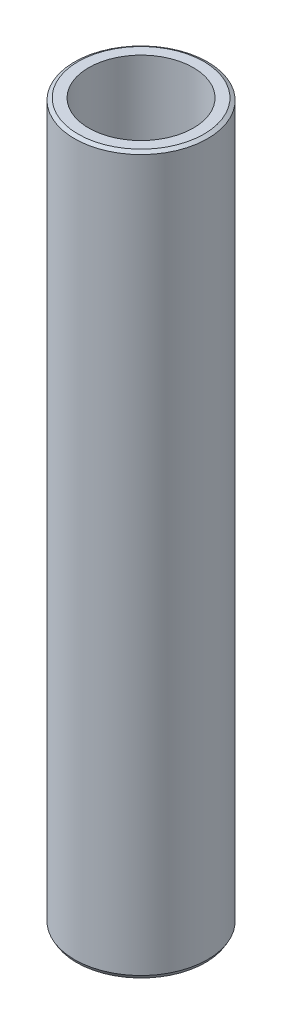
ISO-10303-21;
HEADER;
FILE_DESCRIPTION(('STEP AP214'),'2;1');
FILE_NAME('part.step','',(''),(''),'','','');
FILE_SCHEMA(('AUTOMOTIVE_DESIGN { 1 0 10303 214 1 1 1 1 }'));
ENDSEC;
DATA;
#1=APPLICATION_CONTEXT('core data for automotive mechanical design processes');
#2=APPLICATION_PROTOCOL_DEFINITION('international standard','automotive_design',2000,#1);
#3=PRODUCT_CONTEXT('',#1,'mechanical');
#4=PRODUCT('Part','Part','',(#3));
#5=PRODUCT_RELATED_PRODUCT_CATEGORY('part','',(#4));
#6=PRODUCT_DEFINITION_FORMATION('','',#4);
#7=PRODUCT_DEFINITION_CONTEXT('part definition',#1,'design');
#8=PRODUCT_DEFINITION('design','',#6,#7);
#9=PRODUCT_DEFINITION_SHAPE('','',#8);
#10=(LENGTH_UNIT() NAMED_UNIT(*) SI_UNIT(.MILLI.,.METRE.));
#11=(NAMED_UNIT(*) PLANE_ANGLE_UNIT() SI_UNIT($,.RADIAN.));
#12=(NAMED_UNIT(*) SI_UNIT($,.STERADIAN.) SOLID_ANGLE_UNIT());
#13=UNCERTAINTY_MEASURE_WITH_UNIT(LENGTH_MEASURE(1.E-05),#10,'distance_accuracy_value','');
#14=(GEOMETRIC_REPRESENTATION_CONTEXT(3) GLOBAL_UNCERTAINTY_ASSIGNED_CONTEXT((#13)) GLOBAL_UNIT_ASSIGNED_CONTEXT((#10,
#11,#12)) REPRESENTATION_CONTEXT('',''));
#15=CARTESIAN_POINT('',(0.,0.,0.));
#16=DIRECTION('',(0.,0.,1.));
#17=DIRECTION('',(1.,0.,0.));
#18=AXIS2_PLACEMENT_3D('',#15,#16,#17);
#19=CARTESIAN_POINT('',(0.,484.659316944639,0.));
#20=DIRECTION('',(0.,-1.,0.));
#21=DIRECTION('',(0.,0.,-1.));
#22=AXIS2_PLACEMENT_3D('',#19,#20,#21);
#23=CYLINDRICAL_SURFACE('',#22,45.);
#24=CARTESIAN_POINT('',(0.,483.230887353075,0.));
#25=DIRECTION('',(0.,1.,0.));
#26=DIRECTION('',(0.,0.,1.));
#27=AXIS2_PLACEMENT_3D('',#24,#25,#26);
#28=CIRCLE('',#27,45.);
#29=CARTESIAN_POINT('',(0.,483.230887353075,-45.));
#30=VERTEX_POINT('',#29);
#31=EDGE_CURVE('E50',#30,#30,#28,.F.);
#32=CARTESIAN_POINT('',(0.,2.4741126276247,0.));
#33=DIRECTION('',(0.,1.,0.));
#34=DIRECTION('',(0.,0.,1.));
#35=AXIS2_PLACEMENT_3D('',#32,#33,#34);
#36=CIRCLE('',#35,45.);
#37=CARTESIAN_POINT('',(0.,2.4741126276247,-45.));
#38=VERTEX_POINT('',#37);
#39=EDGE_CURVE('E51',#38,#38,#36,.T.);
#40=CARTESIAN_POINT('',(0.,483.230887353075,-45.));
#41=CARTESIAN_POINT('',(0.,478.223004283018,-45.));
#42=CARTESIAN_POINT('',(0.,473.215121212961,-45.));
#43=CARTESIAN_POINT('',(0.,463.199355072848,-45.));
#44=CARTESIAN_POINT('',(0.,458.191472002791,-45.));
#45=CARTESIAN_POINT('',(0.,448.175705862677,-45.));
#46=CARTESIAN_POINT('',(0.,443.167822792621,-45.));
#47=CARTESIAN_POINT('',(0.,433.152056652507,-45.));
#48=CARTESIAN_POINT('',(0.,428.14417358245,-45.));
#49=CARTESIAN_POINT('',(0.,418.128407442337,-45.));
#50=CARTESIAN_POINT('',(0.,413.12052437228,-45.));
#51=CARTESIAN_POINT('',(0.,403.104758232166,-45.));
#52=CARTESIAN_POINT('',(0.,398.09687516211,-45.));
#53=CARTESIAN_POINT('',(0.,388.081109021996,-45.));
#54=CARTESIAN_POINT('',(0.,383.073225951939,-45.));
#55=CARTESIAN_POINT('',(0.,373.057459811826,-45.));
#56=CARTESIAN_POINT('',(0.,368.049576741769,-45.));
#57=CARTESIAN_POINT('',(0.,358.033810601655,-45.));
#58=CARTESIAN_POINT('',(0.,353.025927531599,-45.));
#59=CARTESIAN_POINT('',(0.,343.010161391485,-45.));
#60=CARTESIAN_POINT('',(0.,338.002278321428,-45.));
#61=CARTESIAN_POINT('',(0.,327.986512181315,-45.));
#62=CARTESIAN_POINT('',(0.,322.978629111258,-45.));
#63=CARTESIAN_POINT('',(0.,312.962862971144,-45.));
#64=CARTESIAN_POINT('',(0.,307.954979901088,-45.));
#65=CARTESIAN_POINT('',(0.,297.939213760974,-45.));
#66=CARTESIAN_POINT('',(0.,292.931330690917,-45.));
#67=CARTESIAN_POINT('',(0.,282.915564550804,-45.));
#68=CARTESIAN_POINT('',(0.,277.907681480747,-45.));
#69=CARTESIAN_POINT('',(0.,267.891915340634,-45.));
#70=CARTESIAN_POINT('',(0.,262.884032270577,-45.));
#71=CARTESIAN_POINT('',(0.,252.868266130463,-45.));
#72=CARTESIAN_POINT('',(0.,247.860383060406,-45.));
#73=CARTESIAN_POINT('',(0.,237.844616920293,-45.));
#74=CARTESIAN_POINT('',(0.,232.836733850236,-45.));
#75=CARTESIAN_POINT('',(0.,222.820967710123,-45.));
#76=CARTESIAN_POINT('',(0.,217.813084640066,-45.));
#77=CARTESIAN_POINT('',(0.,207.797318499952,-45.));
#78=CARTESIAN_POINT('',(0.,202.789435429896,-45.));
#79=CARTESIAN_POINT('',(0.,192.773669289782,-45.));
#80=CARTESIAN_POINT('',(0.,187.765786219725,-45.));
#81=CARTESIAN_POINT('',(0.,177.750020079612,-45.));
#82=CARTESIAN_POINT('',(0.,172.742137009555,-45.));
#83=CARTESIAN_POINT('',(0.,162.726370869441,-45.));
#84=CARTESIAN_POINT('',(0.,157.718487799385,-45.));
#85=CARTESIAN_POINT('',(0.,147.702721659271,-45.));
#86=CARTESIAN_POINT('',(0.,142.694838589214,-45.));
#87=CARTESIAN_POINT('',(0.,132.679072449101,-45.));
#88=CARTESIAN_POINT('',(0.,127.671189379044,-45.));
#89=CARTESIAN_POINT('',(0.,117.65542323893,-45.));
#90=CARTESIAN_POINT('',(0.,112.647540168874,-45.));
#91=CARTESIAN_POINT('',(0.,102.63177402876,-45.));
#92=CARTESIAN_POINT('',(0.,97.6238909587034,-45.));
#93=CARTESIAN_POINT('',(0.,87.6081248185898,-45.));
#94=CARTESIAN_POINT('',(0.,82.6002417485331,-45.));
#95=CARTESIAN_POINT('',(0.,72.5844756084195,-45.));
#96=CARTESIAN_POINT('',(0.,67.5765925383628,-45.));
#97=CARTESIAN_POINT('',(0.,57.5608263982492,-45.));
#98=CARTESIAN_POINT('',(0.,52.5529433281925,-45.));
#99=CARTESIAN_POINT('',(0.,42.5371771880789,-45.));
#100=CARTESIAN_POINT('',(0.,37.5292941180221,-45.));
#101=CARTESIAN_POINT('',(0.,27.5135279779085,-45.));
#102=CARTESIAN_POINT('',(0.,22.5056449078518,-45.));
#103=CARTESIAN_POINT('',(0.,12.4898787677382,-45.));
#104=CARTESIAN_POINT('',(0.,7.48199569768147,-45.));
#105=CARTESIAN_POINT('',(0.,2.4741126276247,-45.));
#106=B_SPLINE_CURVE_WITH_KNOTS('',3,(#40,#41,#42,#43,#44,#45,#46,#47,#48,#49,#50,#51,#52,#53,
#54,#55,#56,#57,#58,#59,#60,#61,#62,#63,#64,#65,#66,#67,#68,#69,#70,#71,#72,#73,#74,#75,#76,#77,
#78,#79,#80,#81,#82,#83,#84,#85,#86,#87,#88,#89,#90,#91,#92,#93,#94,#95,#96,#97,#98,#99,#100,
#101,#102,#103,#104,#105),.UNSPECIFIED.,.F.,.F.,(4,2,2,2,2,2,2,2,2,2,2,2,2,2,2,2,2,2,2,2,2,2,2,
2,2,2,2,2,2,2,2,2,4),(0.,15.0236492101704,30.0472984203407,45.070947630511,60.0945968406812,
75.1182460508515,90.1418952610219,105.165544471192,120.189193681362,135.212842891533,
150.236492101703,165.260141311873,180.283790522044,195.307439732214,210.331088942384,
225.354738152555,240.378387362725,255.402036572895,270.425685783066,285.449334993236,
300.472984203406,315.496633413576,330.520282623747,345.543931833917,360.567581044087,
375.591230254258,390.614879464428,405.638528674598,420.662177884769,435.685827094939,
450.709476305109,465.73312551528,480.75677472545),.UNSPECIFIED.);
#107=EDGE_CURVE('BSEAM39',#30,#38,#106,.T.);
#108=ORIENTED_EDGE('',*,*,#31,.T.);
#109=ORIENTED_EDGE('',*,*,#39,.T.);
#110=ORIENTED_EDGE('',*,*,#107,.T.);
#111=ORIENTED_EDGE('',*,*,#107,.F.);
#112=EDGE_LOOP('',(#108,#110,#109,#111));
#113=FACE_BOUND('',#112,.T.);
#114=ADVANCED_FACE('F39',(#113),#23,.T.);
#115=CARTESIAN_POINT('',(0.,484.659316944639,0.));
#116=DIRECTION('',(0.,1.,0.));
#117=DIRECTION('',(0.,0.,1.));
#118=AXIS2_PLACEMENT_3D('',#115,#116,#117);
#119=PLANE('',#118);
#120=CARTESIAN_POINT('',(0.,484.659316944639,0.));
#121=DIRECTION('',(0.,1.,0.));
#122=DIRECTION('',(0.,0.,1.));
#123=AXIS2_PLACEMENT_3D('',#120,#121,#122);
#124=CIRCLE('',#123,42.5258873723763);
#125=CARTESIAN_POINT('',(0.,484.659316944639,42.5258873723763));
#126=VERTEX_POINT('',#125);
#127=EDGE_CURVE('E54',#126,#126,#124,.T.);
#128=ORIENTED_EDGE('',*,*,#127,.T.);
#129=EDGE_LOOP('',(#128));
#130=FACE_BOUND('',#129,.T.);
#131=CARTESIAN_POINT('',(0.,484.659316944639,0.));
#132=DIRECTION('',(0.,1.,0.));
#133=DIRECTION('',(0.,0.,1.));
#134=AXIS2_PLACEMENT_3D('',#131,#132,#133);
#135=CIRCLE('',#134,35.4087724599996);
#136=CARTESIAN_POINT('',(0.,484.659316944639,-35.4087724599996));
#137=VERTEX_POINT('',#136);
#138=EDGE_CURVE('E58',#137,#137,#135,.T.);
#139=ORIENTED_EDGE('',*,*,#138,.F.);
#140=EDGE_LOOP('',(#139));
#141=FACE_BOUND('',#140,.T.);
#142=ADVANCED_FACE('F69',(#130,#141),#119,.T.);
#143=CARTESIAN_POINT('',(0.,0.,0.));
#144=DIRECTION('',(0.,1.,0.));
#145=DIRECTION('',(0.,0.,1.));
#146=AXIS2_PLACEMENT_3D('',#143,#144,#145);
#147=PLANE('',#146);
#148=CARTESIAN_POINT('',(0.,0.,0.));
#149=DIRECTION('',(0.,1.,0.));
#150=DIRECTION('',(0.,0.,1.));
#151=AXIS2_PLACEMENT_3D('',#148,#149,#150);
#152=CIRCLE('',#151,43.5715704084354);
#153=CARTESIAN_POINT('',(0.,0.,43.5715704084354));
#154=VERTEX_POINT('',#153);
#155=EDGE_CURVE('E10',#154,#154,#152,.F.);
#156=ORIENTED_EDGE('',*,*,#155,.T.);
#157=EDGE_LOOP('',(#156));
#158=FACE_BOUND('',#157,.T.);
#159=CARTESIAN_POINT('',(0.,0.,0.));
#160=DIRECTION('',(0.,1.,0.));
#161=DIRECTION('',(0.,0.,1.));
#162=AXIS2_PLACEMENT_3D('',#159,#160,#161);
#163=CIRCLE('',#162,35.4087724599996);
#164=CARTESIAN_POINT('',(0.,0.,-35.4087724599996));
#165=VERTEX_POINT('',#164);
#166=EDGE_CURVE('E63',#165,#165,#163,.T.);
#167=ORIENTED_EDGE('',*,*,#166,.T.);
#168=EDGE_LOOP('',(#167));
#169=FACE_BOUND('',#168,.T.);
#170=ADVANCED_FACE('F75',(#158,#169),#147,.F.);
#171=CARTESIAN_POINT('',(0.,484.659316944639,0.));
#172=DIRECTION('',(0.,-1.,0.));
#173=DIRECTION('',(0.,0.,-1.));
#174=AXIS2_PLACEMENT_3D('',#171,#172,#173);
#175=CYLINDRICAL_SURFACE('',#174,35.4087724599996);
#176=CARTESIAN_POINT('',(0.,484.659316944639,-35.4087724599996));
#177=CARTESIAN_POINT('',(0.,479.610782393132,-35.4087724599996));
#178=CARTESIAN_POINT('',(0.,474.562247841625,-35.4087724599996));
#179=CARTESIAN_POINT('',(0.,464.465178738612,-35.4087724599996));
#180=CARTESIAN_POINT('',(0.,459.416644187105,-35.4087724599996));
#181=CARTESIAN_POINT('',(0.,449.319575084092,-35.4087724599996));
#182=CARTESIAN_POINT('',(0.,444.271040532585,-35.4087724599996));
#183=CARTESIAN_POINT('',(0.,434.173971429572,-35.4087724599996));
#184=CARTESIAN_POINT('',(0.,429.125436878065,-35.4087724599996));
#185=CARTESIAN_POINT('',(0.,419.028367775052,-35.4087724599996));
#186=CARTESIAN_POINT('',(0.,413.979833223545,-35.4087724599996));
#187=CARTESIAN_POINT('',(0.,403.882764120532,-35.4087724599996));
#188=CARTESIAN_POINT('',(0.,398.834229569025,-35.4087724599996));
#189=CARTESIAN_POINT('',(0.,388.737160466012,-35.4087724599996));
#190=CARTESIAN_POINT('',(0.,383.688625914506,-35.4087724599996));
#191=CARTESIAN_POINT('',(0.,373.591556811492,-35.4087724599996));
#192=CARTESIAN_POINT('',(0.,368.543022259986,-35.4087724599996));
#193=CARTESIAN_POINT('',(0.,358.445953156972,-35.4087724599996));
#194=CARTESIAN_POINT('',(0.,353.397418605466,-35.4087724599996));
#195=CARTESIAN_POINT('',(0.,343.300349502452,-35.4087724599996));
#196=CARTESIAN_POINT('',(0.,338.251814950946,-35.4087724599996));
#197=CARTESIAN_POINT('',(0.,328.154745847932,-35.4087724599996));
#198=CARTESIAN_POINT('',(0.,323.106211296426,-35.4087724599996));
#199=CARTESIAN_POINT('',(0.,313.009142193412,-35.4087724599996));
#200=CARTESIAN_POINT('',(0.,307.960607641906,-35.4087724599996));
#201=CARTESIAN_POINT('',(0.,297.863538538892,-35.4087724599996));
#202=CARTESIAN_POINT('',(0.,292.815003987386,-35.4087724599996));
#203=CARTESIAN_POINT('',(0.,282.717934884372,-35.4087724599996));
#204=CARTESIAN_POINT('',(0.,277.669400332866,-35.4087724599996));
#205=CARTESIAN_POINT('',(0.,267.572331229853,-35.4087724599996));
#206=CARTESIAN_POINT('',(0.,262.523796678346,-35.4087724599996));
#207=CARTESIAN_POINT('',(0.,252.426727575333,-35.4087724599996));
#208=CARTESIAN_POINT('',(0.,247.378193023826,-35.4087724599996));
#209=CARTESIAN_POINT('',(0.,237.281123920813,-35.4087724599996));
#210=CARTESIAN_POINT('',(0.,232.232589369306,-35.4087724599996));
#211=CARTESIAN_POINT('',(0.,222.135520266293,-35.4087724599996));
#212=CARTESIAN_POINT('',(0.,217.086985714786,-35.4087724599996));
#213=CARTESIAN_POINT('',(0.,206.989916611773,-35.4087724599996));
#214=CARTESIAN_POINT('',(0.,201.941382060266,-35.4087724599996));
#215=CARTESIAN_POINT('',(0.,191.844312957253,-35.4087724599996));
#216=CARTESIAN_POINT('',(0.,186.795778405746,-35.4087724599996));
#217=CARTESIAN_POINT('',(0.,176.698709302733,-35.4087724599996));
#218=CARTESIAN_POINT('',(0.,171.650174751226,-35.4087724599996));
#219=CARTESIAN_POINT('',(0.,161.553105648213,-35.4087724599996));
#220=CARTESIAN_POINT('',(0.,156.504571096706,-35.4087724599996));
#221=CARTESIAN_POINT('',(0.,146.407501993693,-35.4087724599996));
#222=CARTESIAN_POINT('',(0.,141.358967442186,-35.4087724599996));
#223=CARTESIAN_POINT('',(0.,131.261898339173,-35.4087724599996));
#224=CARTESIAN_POINT('',(0.,126.213363787666,-35.4087724599996));
#225=CARTESIAN_POINT('',(0.,116.116294684653,-35.4087724599996));
#226=CARTESIAN_POINT('',(0.,111.067760133146,-35.4087724599996));
#227=CARTESIAN_POINT('',(0.,100.970691030133,-35.4087724599996));
#228=CARTESIAN_POINT('',(0.,95.9221564786263,-35.4087724599996));
#229=CARTESIAN_POINT('',(0.,85.825087375613,-35.4087724599996));
#230=CARTESIAN_POINT('',(0.,80.7765528241064,-35.4087724599996));
#231=CARTESIAN_POINT('',(0.,70.6794837210931,-35.4087724599996));
#232=CARTESIAN_POINT('',(0.,65.6309491695864,-35.4087724599996));
#233=CARTESIAN_POINT('',(0.,55.5338800665731,-35.4087724599996));
#234=CARTESIAN_POINT('',(0.,50.4853455150665,-35.4087724599996));
#235=CARTESIAN_POINT('',(0.,40.3882764120532,-35.4087724599996));
#236=CARTESIAN_POINT('',(0.,35.3397418605465,-35.4087724599996));
#237=CARTESIAN_POINT('',(0.,25.2426727575332,-35.4087724599996));
#238=CARTESIAN_POINT('',(0.,20.1941382060265,-35.4087724599996));
#239=CARTESIAN_POINT('',(0.,10.0970691030132,-35.4087724599996));
#240=CARTESIAN_POINT('',(0.,5.04853455150659,-35.4087724599996));
#241=CARTESIAN_POINT('',(0.,0.,-35.4087724599996));
#242=B_SPLINE_CURVE_WITH_KNOTS('',3,(#176,#177,#178,#179,#180,#181,#182,#183,#184,#185,#186,
#187,#188,#189,#190,#191,#192,#193,#194,#195,#196,#197,#198,#199,#200,#201,#202,#203,#204,#205,
#206,#207,#208,#209,#210,#211,#212,#213,#214,#215,#216,#217,#218,#219,#220,#221,#222,#223,#224,
#225,#226,#227,#228,#229,#230,#231,#232,#233,#234,#235,#236,#237,#238,#239,#240,#241),
.UNSPECIFIED.,.F.,.F.,(4,2,2,2,2,2,2,2,2,2,2,2,2,2,2,2,2,2,2,2,2,2,2,2,2,2,2,2,2,2,2,2,4),(0.,
15.1456036545199,30.2912073090399,45.4368109635598,60.5824146180798,75.7280182725997,
90.8736219271197,106.01922558164,121.16482923616,136.31043289068,151.4560365452,166.60164019972,
181.747243854239,196.892847508759,212.038451163279,227.184054817799,242.329658472319,
257.475262126839,272.620865781359,287.766469435879,302.912073090399,318.057676744919,
333.203280399439,348.348884053959,363.494487708479,378.640091362999,393.785695017519,
408.931298672039,424.076902326559,439.222505981079,454.368109635599,469.513713290119,
484.659316944639),.UNSPECIFIED.);
#243=EDGE_CURVE('BSEAM70',#137,#165,#242,.T.);
#244=ORIENTED_EDGE('',*,*,#138,.T.);
#245=ORIENTED_EDGE('',*,*,#166,.F.);
#246=ORIENTED_EDGE('',*,*,#243,.T.);
#247=ORIENTED_EDGE('',*,*,#243,.F.);
#248=EDGE_LOOP('',(#244,#246,#245,#247));
#249=FACE_BOUND('',#248,.T.);
#250=ADVANCED_FACE('F70',(#249),#175,.F.);
#251=CARTESIAN_POINT('',(0.,484.659316944639,0.));
#252=DIRECTION('',(0.,-1.,0.));
#253=DIRECTION('',(0.,0.,-1.));
#254=AXIS2_PLACEMENT_3D('',#251,#252,#253);
#255=CONICAL_SURFACE('',#254,42.5258873723763,1.04719755119662);
#256=ORIENTED_EDGE('',*,*,#31,.F.);
#257=EDGE_LOOP('',(#256));
#258=FACE_BOUND('',#257,.T.);
#259=ORIENTED_EDGE('',*,*,#127,.F.);
#260=EDGE_LOOP('',(#259));
#261=FACE_BOUND('',#260,.T.);
#262=ADVANCED_FACE('F81',(#258,#261),#255,.T.);
#263=CARTESIAN_POINT('',(0.,2.4741126276247,0.));
#264=DIRECTION('',(0.,1.,0.));
#265=DIRECTION('',(0.,0.,1.));
#266=AXIS2_PLACEMENT_3D('',#263,#264,#265);
#267=CONICAL_SURFACE('',#266,45.,0.523598775598304);
#268=ORIENTED_EDGE('',*,*,#155,.F.);
#269=EDGE_LOOP('',(#268));
#270=FACE_BOUND('',#269,.T.);
#271=ORIENTED_EDGE('',*,*,#39,.F.);
#272=EDGE_LOOP('',(#271));
#273=FACE_BOUND('',#272,.T.);
#274=ADVANCED_FACE('F45',(#270,#273),#267,.T.);
#275=CLOSED_SHELL('',(#114,#142,#170,#250,#262,#274));
#276=MANIFOLD_SOLID_BREP('B2',#275);
#277=ADVANCED_BREP_SHAPE_REPRESENTATION('',(#18,#276),#14);
#278=SHAPE_DEFINITION_REPRESENTATION(#9,#277);
ENDSEC;
END-ISO-10303-21;
